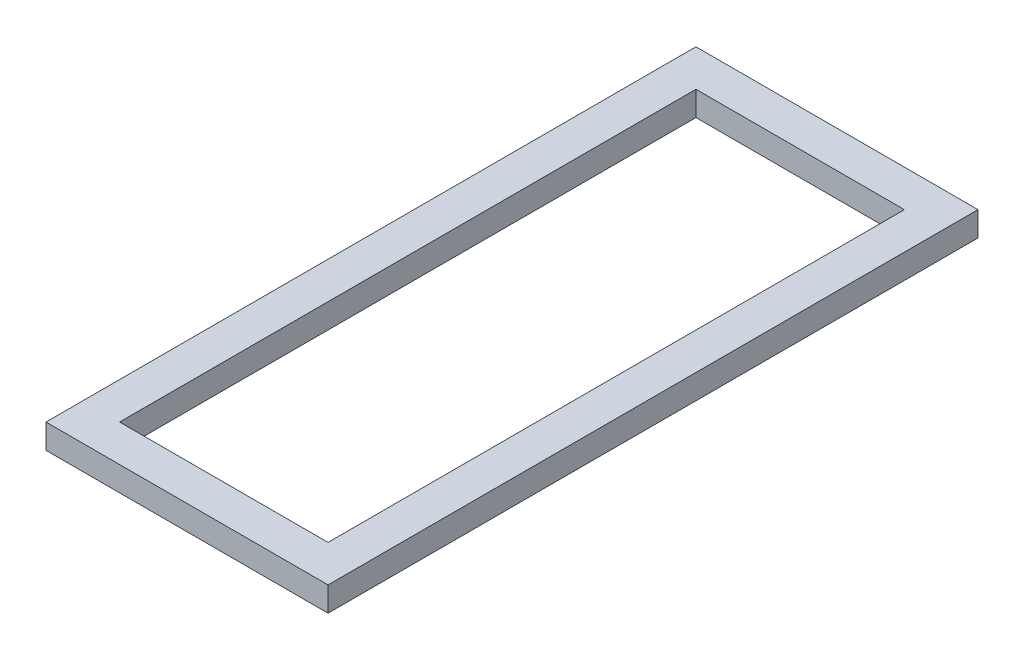
ISO-10303-21;
HEADER;
FILE_DESCRIPTION(('STEP AP214'),'2;1');
FILE_NAME('part.step','',(''),(''),'','','');
FILE_SCHEMA(('AUTOMOTIVE_DESIGN { 1 0 10303 214 1 1 1 1 }'));
ENDSEC;
DATA;
#1=APPLICATION_CONTEXT('core data for automotive mechanical design processes');
#2=APPLICATION_PROTOCOL_DEFINITION('international standard','automotive_design',2000,#1);
#3=PRODUCT_CONTEXT('',#1,'mechanical');
#4=PRODUCT('Part','Part','',(#3));
#5=PRODUCT_RELATED_PRODUCT_CATEGORY('part','',(#4));
#6=PRODUCT_DEFINITION_FORMATION('','',#4);
#7=PRODUCT_DEFINITION_CONTEXT('part definition',#1,'design');
#8=PRODUCT_DEFINITION('design','',#6,#7);
#9=PRODUCT_DEFINITION_SHAPE('','',#8);
#10=(LENGTH_UNIT() NAMED_UNIT(*) SI_UNIT(.MILLI.,.METRE.));
#11=(NAMED_UNIT(*) PLANE_ANGLE_UNIT() SI_UNIT($,.RADIAN.));
#12=(NAMED_UNIT(*) SI_UNIT($,.STERADIAN.) SOLID_ANGLE_UNIT());
#13=UNCERTAINTY_MEASURE_WITH_UNIT(LENGTH_MEASURE(1.E-05),#10,'distance_accuracy_value','');
#14=(GEOMETRIC_REPRESENTATION_CONTEXT(3) GLOBAL_UNCERTAINTY_ASSIGNED_CONTEXT((#13)) GLOBAL_UNIT_ASSIGNED_CONTEXT((#10,
#11,#12)) REPRESENTATION_CONTEXT('',''));
#15=CARTESIAN_POINT('',(0.,0.,0.));
#16=DIRECTION('',(0.,0.,1.));
#17=DIRECTION('',(1.,0.,0.));
#18=AXIS2_PLACEMENT_3D('',#15,#16,#17);
#19=CARTESIAN_POINT('',(0.,20.,0.));
#20=DIRECTION('',(0.,1.,0.));
#21=DIRECTION('',(0.,0.,1.));
#22=AXIS2_PLACEMENT_3D('',#19,#20,#21);
#23=PLANE('',#22);
#24=DIRECTION('',(0.,0.,1.));
#25=VECTOR('',#24,1.);
#26=CARTESIAN_POINT('',(-109.063926940639,20.,-363.926940639269));
#27=LINE('',#26,#25);
#28=CARTESIAN_POINT('',(-109.063926940639,20.,-378.926940639269));
#29=VERTEX_POINT('',#28);
#30=CARTESIAN_POINT('',(-109.063926940639,20.,151.07305936073));
#31=VERTEX_POINT('',#30);
#32=EDGE_CURVE('E163',#29,#31,#27,.T.);
#33=ORIENTED_EDGE('',*,*,#32,.T.);
#34=DIRECTION('',(1.,0.,0.));
#35=VECTOR('',#34,1.);
#36=CARTESIAN_POINT('',(-94.0639269406392,20.,151.07305936073));
#37=LINE('',#36,#35);
#38=CARTESIAN_POINT('',(120.936073059361,20.,151.07305936073));
#39=VERTEX_POINT('',#38);
#40=EDGE_CURVE('E166',#31,#39,#37,.T.);
#41=ORIENTED_EDGE('',*,*,#40,.T.);
#42=DIRECTION('',(0.,0.,-1.));
#43=VECTOR('',#42,1.);
#44=CARTESIAN_POINT('',(120.936073059361,20.,-363.926940639269));
#45=LINE('',#44,#43);
#46=CARTESIAN_POINT('',(120.936073059361,20.,-378.926940639269));
#47=VERTEX_POINT('',#46);
#48=EDGE_CURVE('E169',#39,#47,#45,.T.);
#49=ORIENTED_EDGE('',*,*,#48,.T.);
#50=DIRECTION('',(-1.,0.,0.));
#51=VECTOR('',#50,1.);
#52=CARTESIAN_POINT('',(-94.0639269406393,20.,-378.926940639269));
#53=LINE('',#52,#51);
#54=EDGE_CURVE('E171',#47,#29,#53,.T.);
#55=ORIENTED_EDGE('',*,*,#54,.T.);
#56=EDGE_LOOP('',(#33,#41,#49,#55));
#57=FACE_BOUND('',#56,.T.);
#58=DIRECTION('',(1.,0.,0.));
#59=VECTOR('',#58,1.);
#60=CARTESIAN_POINT('',(-94.0639269406392,20.,121.073059360731));
#61=LINE('',#60,#59);
#62=CARTESIAN_POINT('',(-79.0639269406392,20.,121.073059360731));
#63=VERTEX_POINT('',#62);
#64=CARTESIAN_POINT('',(90.9360730593608,20.,121.073059360731));
#65=VERTEX_POINT('',#64);
#66=EDGE_CURVE('E135',#63,#65,#61,.T.);
#67=ORIENTED_EDGE('',*,*,#66,.F.);
#68=DIRECTION('',(0.,0.,1.));
#69=VECTOR('',#68,1.);
#70=CARTESIAN_POINT('',(-79.0639269406393,20.,-363.926940639269));
#71=LINE('',#70,#69);
#72=CARTESIAN_POINT('',(-79.0639269406393,20.,-348.926940639269));
#73=VERTEX_POINT('',#72);
#74=EDGE_CURVE('E127',#73,#63,#71,.T.);
#75=ORIENTED_EDGE('',*,*,#74,.F.);
#76=DIRECTION('',(-1.,0.,0.));
#77=VECTOR('',#76,1.);
#78=CARTESIAN_POINT('',(-94.0639269406393,20.,-348.926940639269));
#79=LINE('',#78,#77);
#80=CARTESIAN_POINT('',(90.9360730593607,20.,-348.926940639269));
#81=VERTEX_POINT('',#80);
#82=EDGE_CURVE('E149',#81,#73,#79,.T.);
#83=ORIENTED_EDGE('',*,*,#82,.F.);
#84=DIRECTION('',(0.,0.,-1.));
#85=VECTOR('',#84,1.);
#86=CARTESIAN_POINT('',(90.9360730593607,20.,-363.926940639269));
#87=LINE('',#86,#85);
#88=EDGE_CURVE('E147',#65,#81,#87,.T.);
#89=ORIENTED_EDGE('',*,*,#88,.F.);
#90=EDGE_LOOP('',(#67,#75,#83,#89));
#91=FACE_BOUND('',#90,.T.);
#92=ADVANCED_FACE('F62',(#57,#91),#23,.T.);
#93=CARTESIAN_POINT('',(0.,0.,0.));
#94=DIRECTION('',(0.,1.,0.));
#95=DIRECTION('',(0.,0.,1.));
#96=AXIS2_PLACEMENT_3D('',#93,#94,#95);
#97=PLANE('',#96);
#98=DIRECTION('',(0.,0.,1.));
#99=VECTOR('',#98,1.);
#100=CARTESIAN_POINT('',(-109.063926940639,0.,-363.926940639269));
#101=LINE('',#100,#99);
#102=CARTESIAN_POINT('',(-109.063926940639,0.,-378.926940639269));
#103=VERTEX_POINT('',#102);
#104=CARTESIAN_POINT('',(-109.063926940639,0.,151.07305936073));
#105=VERTEX_POINT('',#104);
#106=EDGE_CURVE('E143',#103,#105,#101,.T.);
#107=ORIENTED_EDGE('',*,*,#106,.F.);
#108=DIRECTION('',(-1.,0.,0.));
#109=VECTOR('',#108,1.);
#110=CARTESIAN_POINT('',(-94.0639269406393,0.,-378.926940639269));
#111=LINE('',#110,#109);
#112=CARTESIAN_POINT('',(120.936073059361,0.,-378.926940639269));
#113=VERTEX_POINT('',#112);
#114=EDGE_CURVE('E167',#113,#103,#111,.T.);
#115=ORIENTED_EDGE('',*,*,#114,.F.);
#116=DIRECTION('',(0.,0.,-1.));
#117=VECTOR('',#116,1.);
#118=CARTESIAN_POINT('',(120.936073059361,0.,-363.926940639269));
#119=LINE('',#118,#117);
#120=CARTESIAN_POINT('',(120.936073059361,0.,151.07305936073));
#121=VERTEX_POINT('',#120);
#122=EDGE_CURVE('E178',#121,#113,#119,.T.);
#123=ORIENTED_EDGE('',*,*,#122,.F.);
#124=DIRECTION('',(1.,0.,0.));
#125=VECTOR('',#124,1.);
#126=CARTESIAN_POINT('',(-94.0639269406392,0.,151.07305936073));
#127=LINE('',#126,#125);
#128=EDGE_CURVE('E176',#105,#121,#127,.T.);
#129=ORIENTED_EDGE('',*,*,#128,.F.);
#130=EDGE_LOOP('',(#107,#115,#123,#129));
#131=FACE_BOUND('',#130,.T.);
#132=DIRECTION('',(0.,0.,1.));
#133=VECTOR('',#132,1.);
#134=CARTESIAN_POINT('',(-79.0639269406393,0.,-363.926940639269));
#135=LINE('',#134,#133);
#136=CARTESIAN_POINT('',(-79.0639269406393,0.,-348.926940639269));
#137=VERTEX_POINT('',#136);
#138=CARTESIAN_POINT('',(-79.0639269406392,0.,121.073059360731));
#139=VERTEX_POINT('',#138);
#140=EDGE_CURVE('E85',#137,#139,#135,.T.);
#141=ORIENTED_EDGE('',*,*,#140,.T.);
#142=DIRECTION('',(1.,0.,0.));
#143=VECTOR('',#142,1.);
#144=CARTESIAN_POINT('',(-94.0639269406392,0.,121.073059360731));
#145=LINE('',#144,#143);
#146=CARTESIAN_POINT('',(90.9360730593608,0.,121.073059360731));
#147=VERTEX_POINT('',#146);
#148=EDGE_CURVE('E142',#139,#147,#145,.T.);
#149=ORIENTED_EDGE('',*,*,#148,.T.);
#150=DIRECTION('',(0.,0.,-1.));
#151=VECTOR('',#150,1.);
#152=CARTESIAN_POINT('',(90.9360730593607,0.,-363.926940639269));
#153=LINE('',#152,#151);
#154=CARTESIAN_POINT('',(90.9360730593607,0.,-348.926940639269));
#155=VERTEX_POINT('',#154);
#156=EDGE_CURVE('E155',#147,#155,#153,.T.);
#157=ORIENTED_EDGE('',*,*,#156,.T.);
#158=DIRECTION('',(-1.,0.,0.));
#159=VECTOR('',#158,1.);
#160=CARTESIAN_POINT('',(-94.0639269406393,0.,-348.926940639269));
#161=LINE('',#160,#159);
#162=EDGE_CURVE('E136',#155,#137,#161,.T.);
#163=ORIENTED_EDGE('',*,*,#162,.T.);
#164=EDGE_LOOP('',(#141,#149,#157,#163));
#165=FACE_BOUND('',#164,.T.);
#166=ADVANCED_FACE('F196',(#131,#165),#97,.F.);
#167=CARTESIAN_POINT('',(-109.063926940639,20.,-363.926940639269));
#168=DIRECTION('',(1.,0.,0.));
#169=DIRECTION('',(0.,0.,-1.));
#170=AXIS2_PLACEMENT_3D('',#167,#168,#169);
#171=PLANE('',#170);
#172=ORIENTED_EDGE('',*,*,#106,.T.);
#173=DIRECTION('',(0.,-1.,0.));
#174=VECTOR('',#173,1.);
#175=CARTESIAN_POINT('',(-109.063926940639,20.,151.07305936073));
#176=LINE('',#175,#174);
#177=EDGE_CURVE('E12',#31,#105,#176,.T.);
#178=ORIENTED_EDGE('',*,*,#177,.F.);
#179=ORIENTED_EDGE('',*,*,#32,.F.);
#180=DIRECTION('',(0.,-1.,0.));
#181=VECTOR('',#180,1.);
#182=CARTESIAN_POINT('',(-109.063926940639,20.,-378.926940639269));
#183=LINE('',#182,#181);
#184=EDGE_CURVE('E173',#29,#103,#183,.T.);
#185=ORIENTED_EDGE('',*,*,#184,.T.);
#186=EDGE_LOOP('',(#172,#178,#179,#185));
#187=FACE_BOUND('',#186,.T.);
#188=ADVANCED_FACE('F64',(#187),#171,.F.);
#189=CARTESIAN_POINT('',(-94.0639269406392,20.,151.07305936073));
#190=DIRECTION('',(0.,0.,-1.));
#191=DIRECTION('',(-1.,0.,0.));
#192=AXIS2_PLACEMENT_3D('',#189,#190,#191);
#193=PLANE('',#192);
#194=ORIENTED_EDGE('',*,*,#128,.T.);
#195=DIRECTION('',(0.,-1.,0.));
#196=VECTOR('',#195,1.);
#197=CARTESIAN_POINT('',(120.936073059361,20.,151.07305936073));
#198=LINE('',#197,#196);
#199=EDGE_CURVE('E70',#39,#121,#198,.T.);
#200=ORIENTED_EDGE('',*,*,#199,.F.);
#201=ORIENTED_EDGE('',*,*,#40,.F.);
#202=ORIENTED_EDGE('',*,*,#177,.T.);
#203=EDGE_LOOP('',(#194,#200,#201,#202));
#204=FACE_BOUND('',#203,.T.);
#205=ADVANCED_FACE('F206',(#204),#193,.F.);
#206=CARTESIAN_POINT('',(120.936073059361,20.,-363.926940639269));
#207=DIRECTION('',(-1.,0.,0.));
#208=DIRECTION('',(0.,0.,1.));
#209=AXIS2_PLACEMENT_3D('',#206,#207,#208);
#210=PLANE('',#209);
#211=ORIENTED_EDGE('',*,*,#122,.T.);
#212=DIRECTION('',(0.,-1.,0.));
#213=VECTOR('',#212,1.);
#214=CARTESIAN_POINT('',(120.936073059361,20.,-378.926940639269));
#215=LINE('',#214,#213);
#216=EDGE_CURVE('E183',#47,#113,#215,.T.);
#217=ORIENTED_EDGE('',*,*,#216,.F.);
#218=ORIENTED_EDGE('',*,*,#48,.F.);
#219=ORIENTED_EDGE('',*,*,#199,.T.);
#220=EDGE_LOOP('',(#211,#217,#218,#219));
#221=FACE_BOUND('',#220,.T.);
#222=ADVANCED_FACE('F190',(#221),#210,.F.);
#223=CARTESIAN_POINT('',(-94.0639269406393,20.,-378.926940639269));
#224=DIRECTION('',(0.,0.,1.));
#225=DIRECTION('',(1.,0.,0.));
#226=AXIS2_PLACEMENT_3D('',#223,#224,#225);
#227=PLANE('',#226);
#228=ORIENTED_EDGE('',*,*,#114,.T.);
#229=ORIENTED_EDGE('',*,*,#184,.F.);
#230=ORIENTED_EDGE('',*,*,#54,.F.);
#231=ORIENTED_EDGE('',*,*,#216,.T.);
#232=EDGE_LOOP('',(#228,#229,#230,#231));
#233=FACE_BOUND('',#232,.T.);
#234=ADVANCED_FACE('F200',(#233),#227,.F.);
#235=CARTESIAN_POINT('',(-79.0639269406393,20.,-363.926940639269));
#236=DIRECTION('',(1.,0.,0.));
#237=DIRECTION('',(0.,0.,-1.));
#238=AXIS2_PLACEMENT_3D('',#235,#236,#237);
#239=PLANE('',#238);
#240=ORIENTED_EDGE('',*,*,#140,.F.);
#241=DIRECTION('',(0.,-1.,0.));
#242=VECTOR('',#241,1.);
#243=CARTESIAN_POINT('',(-79.0639269406393,20.,-348.926940639269));
#244=LINE('',#243,#242);
#245=EDGE_CURVE('E131',#73,#137,#244,.T.);
#246=ORIENTED_EDGE('',*,*,#245,.F.);
#247=ORIENTED_EDGE('',*,*,#74,.T.);
#248=DIRECTION('',(0.,-1.,0.));
#249=VECTOR('',#248,1.);
#250=CARTESIAN_POINT('',(-79.0639269406392,20.,121.073059360731));
#251=LINE('',#250,#249);
#252=EDGE_CURVE('E130',#63,#139,#251,.T.);
#253=ORIENTED_EDGE('',*,*,#252,.T.);
#254=EDGE_LOOP('',(#240,#246,#247,#253));
#255=FACE_BOUND('',#254,.T.);
#256=ADVANCED_FACE('F129',(#255),#239,.T.);
#257=CARTESIAN_POINT('',(-94.0639269406392,20.,121.073059360731));
#258=DIRECTION('',(0.,0.,-1.));
#259=DIRECTION('',(-1.,0.,0.));
#260=AXIS2_PLACEMENT_3D('',#257,#258,#259);
#261=PLANE('',#260);
#262=ORIENTED_EDGE('',*,*,#148,.F.);
#263=ORIENTED_EDGE('',*,*,#252,.F.);
#264=ORIENTED_EDGE('',*,*,#66,.T.);
#265=DIRECTION('',(0.,-1.,0.));
#266=VECTOR('',#265,1.);
#267=CARTESIAN_POINT('',(90.9360730593608,20.,121.073059360731));
#268=LINE('',#267,#266);
#269=EDGE_CURVE('E144',#65,#147,#268,.T.);
#270=ORIENTED_EDGE('',*,*,#269,.T.);
#271=EDGE_LOOP('',(#262,#263,#264,#270));
#272=FACE_BOUND('',#271,.T.);
#273=ADVANCED_FACE('F139',(#272),#261,.T.);
#274=CARTESIAN_POINT('',(90.9360730593607,20.,-363.926940639269));
#275=DIRECTION('',(-1.,0.,0.));
#276=DIRECTION('',(0.,0.,1.));
#277=AXIS2_PLACEMENT_3D('',#274,#275,#276);
#278=PLANE('',#277);
#279=ORIENTED_EDGE('',*,*,#156,.F.);
#280=ORIENTED_EDGE('',*,*,#269,.F.);
#281=ORIENTED_EDGE('',*,*,#88,.T.);
#282=DIRECTION('',(0.,-1.,0.));
#283=VECTOR('',#282,1.);
#284=CARTESIAN_POINT('',(90.9360730593607,20.,-348.926940639269));
#285=LINE('',#284,#283);
#286=EDGE_CURVE('E77',#81,#155,#285,.T.);
#287=ORIENTED_EDGE('',*,*,#286,.T.);
#288=EDGE_LOOP('',(#279,#280,#281,#287));
#289=FACE_BOUND('',#288,.T.);
#290=ADVANCED_FACE('F229',(#289),#278,.T.);
#291=CARTESIAN_POINT('',(-94.0639269406393,20.,-348.926940639269));
#292=DIRECTION('',(0.,0.,1.));
#293=DIRECTION('',(1.,0.,0.));
#294=AXIS2_PLACEMENT_3D('',#291,#292,#293);
#295=PLANE('',#294);
#296=ORIENTED_EDGE('',*,*,#162,.F.);
#297=ORIENTED_EDGE('',*,*,#286,.F.);
#298=ORIENTED_EDGE('',*,*,#82,.T.);
#299=ORIENTED_EDGE('',*,*,#245,.T.);
#300=EDGE_LOOP('',(#296,#297,#298,#299));
#301=FACE_BOUND('',#300,.T.);
#302=ADVANCED_FACE('F233',(#301),#295,.T.);
#303=CLOSED_SHELL('',(#92,#166,#188,#205,#222,#234,#256,#273,#290,#302));
#304=MANIFOLD_SOLID_BREP('B2',#303);
#305=ADVANCED_BREP_SHAPE_REPRESENTATION('',(#18,#304),#14);
#306=SHAPE_DEFINITION_REPRESENTATION(#9,#305);
ENDSEC;
END-ISO-10303-21;
